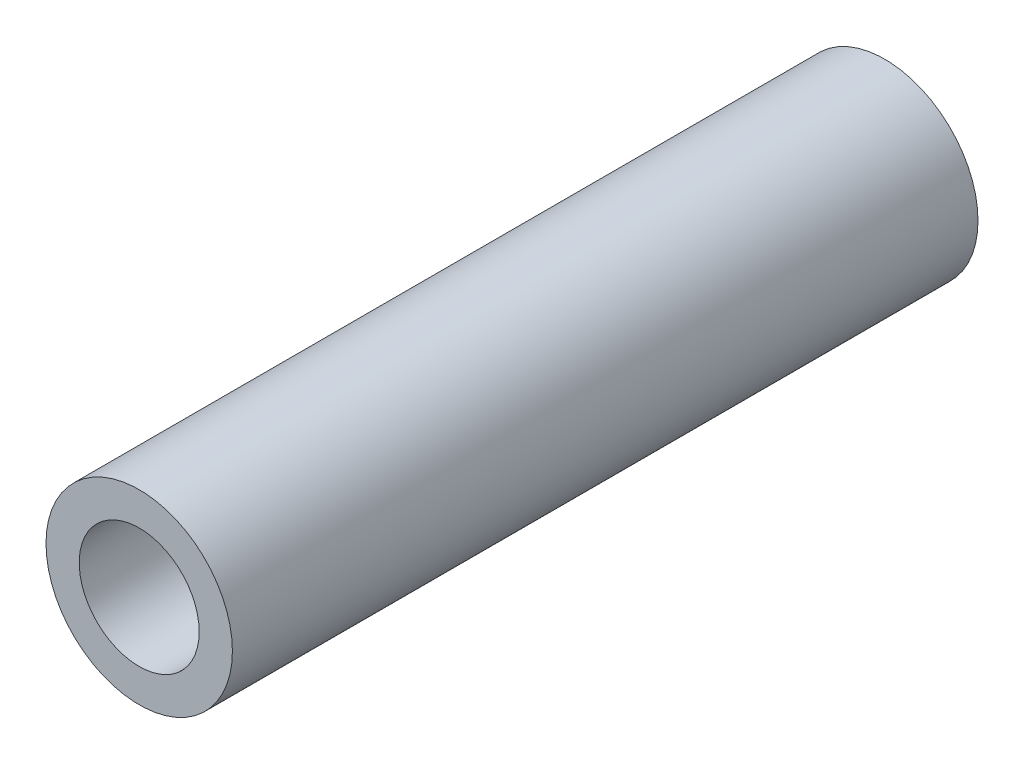
ISO-10303-21;
HEADER;
FILE_DESCRIPTION(('STEP AP214'),'2;1');
FILE_NAME('part.step','',(''),(''),'','','');
FILE_SCHEMA(('AUTOMOTIVE_DESIGN { 1 0 10303 214 1 1 1 1 }'));
ENDSEC;
DATA;
#1=APPLICATION_CONTEXT('core data for automotive mechanical design processes');
#2=APPLICATION_PROTOCOL_DEFINITION('international standard','automotive_design',2000,#1);
#3=PRODUCT_CONTEXT('',#1,'mechanical');
#4=PRODUCT('Part','Part','',(#3));
#5=PRODUCT_RELATED_PRODUCT_CATEGORY('part','',(#4));
#6=PRODUCT_DEFINITION_FORMATION('','',#4);
#7=PRODUCT_DEFINITION_CONTEXT('part definition',#1,'design');
#8=PRODUCT_DEFINITION('design','',#6,#7);
#9=PRODUCT_DEFINITION_SHAPE('','',#8);
#10=(LENGTH_UNIT() NAMED_UNIT(*) SI_UNIT(.MILLI.,.METRE.));
#11=(NAMED_UNIT(*) PLANE_ANGLE_UNIT() SI_UNIT($,.RADIAN.));
#12=(NAMED_UNIT(*) SI_UNIT($,.STERADIAN.) SOLID_ANGLE_UNIT());
#13=UNCERTAINTY_MEASURE_WITH_UNIT(LENGTH_MEASURE(1.E-05),#10,'distance_accuracy_value','');
#14=(GEOMETRIC_REPRESENTATION_CONTEXT(3) GLOBAL_UNCERTAINTY_ASSIGNED_CONTEXT((#13)) GLOBAL_UNIT_ASSIGNED_CONTEXT((#10,
#11,#12)) REPRESENTATION_CONTEXT('',''));
#15=CARTESIAN_POINT('',(0.,0.,0.));
#16=DIRECTION('',(0.,0.,1.));
#17=DIRECTION('',(1.,0.,0.));
#18=AXIS2_PLACEMENT_3D('',#15,#16,#17);
#19=CARTESIAN_POINT('',(0.,0.,31.75));
#20=DIRECTION('',(0.,0.,0.999999999999999));
#21=DIRECTION('',(1.,0.,0.));
#22=AXIS2_PLACEMENT_3D('',#19,#20,#21);
#23=PLANE('',#22);
#24=CARTESIAN_POINT('',(0.,0.,31.75));
#25=DIRECTION('',(0.,0.,0.999999999999999));
#26=DIRECTION('',(1.,0.,0.));
#27=AXIS2_PLACEMENT_3D('',#24,#25,#26);
#28=CIRCLE('',#27,3.96875);
#29=CARTESIAN_POINT('',(3.96875,0.,31.75));
#30=VERTEX_POINT('',#29);
#31=EDGE_CURVE('E10',#30,#30,#28,.T.);
#32=ORIENTED_EDGE('',*,*,#31,.T.);
#33=EDGE_LOOP('',(#32));
#34=FACE_BOUND('',#33,.T.);
#35=CARTESIAN_POINT('',(0.,0.,31.75));
#36=DIRECTION('',(0.,0.,0.999999999999999));
#37=DIRECTION('',(1.,0.,0.));
#38=AXIS2_PLACEMENT_3D('',#35,#36,#37);
#39=CIRCLE('',#38,2.555);
#40=CARTESIAN_POINT('',(2.555,0.,31.75));
#41=VERTEX_POINT('',#40);
#42=EDGE_CURVE('E45',#41,#41,#39,.T.);
#43=ORIENTED_EDGE('',*,*,#42,.F.);
#44=EDGE_LOOP('',(#43));
#45=FACE_BOUND('',#44,.T.);
#46=ADVANCED_FACE('F34',(#34,#45),#23,.T.);
#47=CARTESIAN_POINT('',(0.,0.,0.));
#48=DIRECTION('',(0.,0.,0.999999999999999));
#49=DIRECTION('',(1.,0.,0.));
#50=AXIS2_PLACEMENT_3D('',#47,#48,#49);
#51=PLANE('',#50);
#52=CARTESIAN_POINT('',(0.,0.,0.));
#53=DIRECTION('',(0.,0.,0.999999999999999));
#54=DIRECTION('',(1.,0.,0.));
#55=AXIS2_PLACEMENT_3D('',#52,#53,#54);
#56=CIRCLE('',#55,3.96875);
#57=CARTESIAN_POINT('',(3.96875,0.,0.));
#58=VERTEX_POINT('',#57);
#59=EDGE_CURVE('E38',#58,#58,#56,.T.);
#60=ORIENTED_EDGE('',*,*,#59,.F.);
#61=EDGE_LOOP('',(#60));
#62=FACE_BOUND('',#61,.T.);
#63=CARTESIAN_POINT('',(0.,0.,0.));
#64=DIRECTION('',(0.,0.,0.999999999999999));
#65=DIRECTION('',(1.,0.,0.));
#66=AXIS2_PLACEMENT_3D('',#63,#64,#65);
#67=CIRCLE('',#66,2.555);
#68=CARTESIAN_POINT('',(2.555,0.,0.));
#69=VERTEX_POINT('',#68);
#70=EDGE_CURVE('E47',#69,#69,#67,.T.);
#71=ORIENTED_EDGE('',*,*,#70,.T.);
#72=EDGE_LOOP('',(#71));
#73=FACE_BOUND('',#72,.T.);
#74=ADVANCED_FACE('F57',(#62,#73),#51,.F.);
#75=CARTESIAN_POINT('',(0.,0.,31.75));
#76=DIRECTION('',(0.,0.,-0.999999999999999));
#77=DIRECTION('',(-1.,0.,0.));
#78=AXIS2_PLACEMENT_3D('',#75,#76,#77);
#79=CYLINDRICAL_SURFACE('',#78,3.96875);
#80=ORIENTED_EDGE('',*,*,#31,.F.);
#81=EDGE_LOOP('',(#80));
#82=FACE_BOUND('',#81,.T.);
#83=ORIENTED_EDGE('',*,*,#59,.T.);
#84=EDGE_LOOP('',(#83));
#85=FACE_BOUND('',#84,.T.);
#86=ADVANCED_FACE('F36',(#82,#85),#79,.T.);
#87=CARTESIAN_POINT('',(0.,0.,31.75));
#88=DIRECTION('',(0.,0.,-0.999999999999999));
#89=DIRECTION('',(-1.,0.,0.));
#90=AXIS2_PLACEMENT_3D('',#87,#88,#89);
#91=CYLINDRICAL_SURFACE('',#90,2.555);
#92=ORIENTED_EDGE('',*,*,#42,.T.);
#93=EDGE_LOOP('',(#92));
#94=FACE_BOUND('',#93,.T.);
#95=ORIENTED_EDGE('',*,*,#70,.F.);
#96=EDGE_LOOP('',(#95));
#97=FACE_BOUND('',#96,.T.);
#98=ADVANCED_FACE('F53',(#94,#97),#91,.F.);
#99=CLOSED_SHELL('',(#46,#74,#86,#98));
#100=MANIFOLD_SOLID_BREP('B2',#99);
#101=ADVANCED_BREP_SHAPE_REPRESENTATION('',(#18,#100),#14);
#102=SHAPE_DEFINITION_REPRESENTATION(#9,#101);
ENDSEC;
END-ISO-10303-21;
